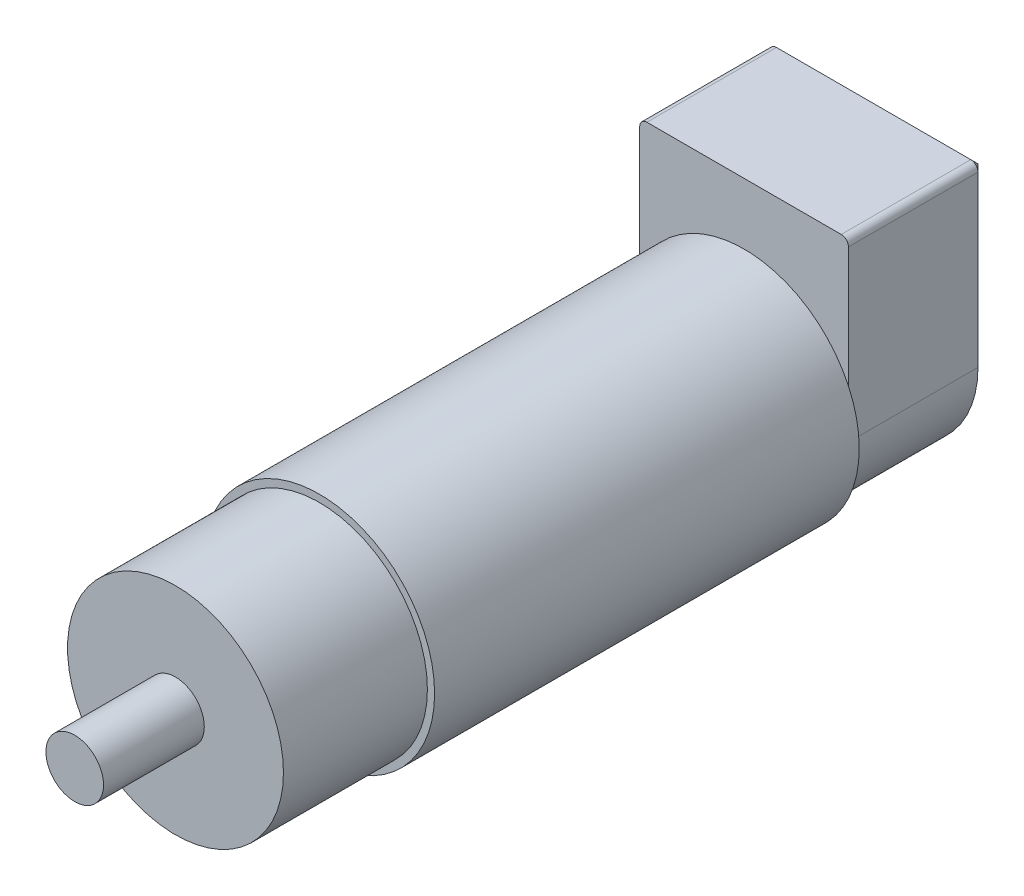
ISO-10303-21;
HEADER;
FILE_DESCRIPTION(('STEP AP214'),'2;1');
FILE_NAME('part.step','',(''),(''),'','','');
FILE_SCHEMA(('AUTOMOTIVE_DESIGN { 1 0 10303 214 1 1 1 1 }'));
ENDSEC;
DATA;
#1=APPLICATION_CONTEXT('core data for automotive mechanical design processes');
#2=APPLICATION_PROTOCOL_DEFINITION('international standard','automotive_design',2000,#1);
#3=PRODUCT_CONTEXT('',#1,'mechanical');
#4=PRODUCT('Part','Part','',(#3));
#5=PRODUCT_RELATED_PRODUCT_CATEGORY('part','',(#4));
#6=PRODUCT_DEFINITION_FORMATION('','',#4);
#7=PRODUCT_DEFINITION_CONTEXT('part definition',#1,'design');
#8=PRODUCT_DEFINITION('design','',#6,#7);
#9=PRODUCT_DEFINITION_SHAPE('','',#8);
#10=(LENGTH_UNIT() NAMED_UNIT(*) SI_UNIT(.MILLI.,.METRE.));
#11=(NAMED_UNIT(*) PLANE_ANGLE_UNIT() SI_UNIT($,.RADIAN.));
#12=(NAMED_UNIT(*) SI_UNIT($,.STERADIAN.) SOLID_ANGLE_UNIT());
#13=UNCERTAINTY_MEASURE_WITH_UNIT(LENGTH_MEASURE(1.E-05),#10,'distance_accuracy_value','');
#14=(GEOMETRIC_REPRESENTATION_CONTEXT(3) GLOBAL_UNCERTAINTY_ASSIGNED_CONTEXT((#13)) GLOBAL_UNIT_ASSIGNED_CONTEXT((#10,
#11,#12)) REPRESENTATION_CONTEXT('',''));
#15=CARTESIAN_POINT('',(0.,0.,0.));
#16=DIRECTION('',(0.,0.,1.));
#17=DIRECTION('',(1.,0.,0.));
#18=AXIS2_PLACEMENT_3D('',#15,#16,#17);
#19=CARTESIAN_POINT('',(0.,0.,0.));
#20=DIRECTION('',(0.,0.,1.));
#21=DIRECTION('',(1.,0.,0.));
#22=AXIS2_PLACEMENT_3D('',#19,#20,#21);
#23=PLANE('',#22);
#24=DIRECTION('',(0.,-1.,0.));
#25=VECTOR('',#24,1.);
#26=CARTESIAN_POINT('',(14.5,0.,0.));
#27=LINE('',#26,#25);
#28=CARTESIAN_POINT('',(14.5,6.76387462923434,0.));
#29=VERTEX_POINT('',#28);
#30=CARTESIAN_POINT('',(14.5,0.,0.));
#31=VERTEX_POINT('',#30);
#32=EDGE_CURVE('E142',#29,#31,#27,.T.);
#33=ORIENTED_EDGE('',*,*,#32,.F.);
#34=CARTESIAN_POINT('',(0.,0.,0.));
#35=DIRECTION('',(0.,0.,1.));
#36=DIRECTION('',(1.,0.,0.));
#37=AXIS2_PLACEMENT_3D('',#34,#35,#36);
#38=CIRCLE('',#37,16.);
#39=CARTESIAN_POINT('',(-14.5,6.76387462923434,0.));
#40=VERTEX_POINT('',#39);
#41=EDGE_CURVE('E162',#40,#29,#38,.T.);
#42=ORIENTED_EDGE('',*,*,#41,.F.);
#43=DIRECTION('',(0.,1.,0.));
#44=VECTOR('',#43,1.);
#45=CARTESIAN_POINT('',(-14.5,0.,0.));
#46=LINE('',#45,#44);
#47=CARTESIAN_POINT('',(-14.5,0.,0.));
#48=VERTEX_POINT('',#47);
#49=EDGE_CURVE('E122',#48,#40,#46,.T.);
#50=ORIENTED_EDGE('',*,*,#49,.F.);
#51=CARTESIAN_POINT('',(0.,0.,0.));
#52=DIRECTION('',(0.,0.,-1.));
#53=DIRECTION('',(-1.,0.,0.));
#54=AXIS2_PLACEMENT_3D('',#51,#52,#53);
#55=CIRCLE('',#54,14.5);
#56=EDGE_CURVE('E125',#31,#48,#55,.T.);
#57=ORIENTED_EDGE('',*,*,#56,.F.);
#58=EDGE_LOOP('',(#33,#42,#50,#57));
#59=FACE_BOUND('',#58,.T.);
#60=ADVANCED_FACE('F35',(#59),#23,.F.);
#61=CARTESIAN_POINT('',(0.,0.,79.));
#62=DIRECTION('',(0.,0.,1.));
#63=DIRECTION('',(1.,0.,0.));
#64=AXIS2_PLACEMENT_3D('',#61,#62,#63);
#65=PLANE('',#64);
#66=CARTESIAN_POINT('',(0.,0.,79.));
#67=DIRECTION('',(0.,0.,1.));
#68=DIRECTION('',(1.,0.,0.));
#69=AXIS2_PLACEMENT_3D('',#66,#67,#68);
#70=CIRCLE('',#69,4.);
#71=CARTESIAN_POINT('',(4.,0.,79.));
#72=VERTEX_POINT('',#71);
#73=EDGE_CURVE('E163',#72,#72,#70,.T.);
#74=ORIENTED_EDGE('',*,*,#73,.F.);
#75=EDGE_LOOP('',(#74));
#76=FACE_BOUND('',#75,.T.);
#77=CARTESIAN_POINT('',(0.,0.,79.));
#78=DIRECTION('',(0.,0.,1.));
#79=DIRECTION('',(1.,0.,0.));
#80=AXIS2_PLACEMENT_3D('',#77,#78,#79);
#81=CIRCLE('',#80,15.);
#82=CARTESIAN_POINT('',(15.,0.,79.));
#83=VERTEX_POINT('',#82);
#84=EDGE_CURVE('E150',#83,#83,#81,.T.);
#85=ORIENTED_EDGE('',*,*,#84,.T.);
#86=EDGE_LOOP('',(#85));
#87=FACE_BOUND('',#86,.T.);
#88=ADVANCED_FACE('F240',(#76,#87),#65,.T.);
#89=CARTESIAN_POINT('',(0.,0.,93.));
#90=DIRECTION('',(0.,0.,-1.));
#91=DIRECTION('',(-1.,0.,0.));
#92=AXIS2_PLACEMENT_3D('',#89,#90,#91);
#93=CYLINDRICAL_SURFACE('',#92,4.);
#94=CARTESIAN_POINT('',(0.,0.,93.));
#95=DIRECTION('',(0.,0.,1.));
#96=DIRECTION('',(1.,0.,0.));
#97=AXIS2_PLACEMENT_3D('',#94,#95,#96);
#98=CIRCLE('',#97,4.);
#99=CARTESIAN_POINT('',(4.,0.,93.));
#100=VERTEX_POINT('',#99);
#101=EDGE_CURVE('E159',#100,#100,#98,.T.);
#102=ORIENTED_EDGE('',*,*,#101,.F.);
#103=EDGE_LOOP('',(#102));
#104=FACE_BOUND('',#103,.T.);
#105=ORIENTED_EDGE('',*,*,#73,.T.);
#106=EDGE_LOOP('',(#105));
#107=FACE_BOUND('',#106,.T.);
#108=ADVANCED_FACE('F235',(#104,#107),#93,.T.);
#109=CARTESIAN_POINT('',(0.,0.,93.));
#110=DIRECTION('',(0.,0.,1.));
#111=DIRECTION('',(1.,0.,0.));
#112=AXIS2_PLACEMENT_3D('',#109,#110,#111);
#113=PLANE('',#112);
#114=ORIENTED_EDGE('',*,*,#101,.T.);
#115=EDGE_LOOP('',(#114));
#116=FACE_BOUND('',#115,.T.);
#117=ADVANCED_FACE('F226',(#116),#113,.T.);
#118=CARTESIAN_POINT('',(0.,0.,59.));
#119=DIRECTION('',(0.,0.,1.));
#120=DIRECTION('',(1.,0.,0.));
#121=AXIS2_PLACEMENT_3D('',#118,#119,#120);
#122=PLANE('',#121);
#123=CARTESIAN_POINT('',(0.,0.,59.));
#124=DIRECTION('',(0.,0.,1.));
#125=DIRECTION('',(1.,0.,0.));
#126=AXIS2_PLACEMENT_3D('',#123,#124,#125);
#127=CIRCLE('',#126,15.);
#128=CARTESIAN_POINT('',(15.,0.,59.));
#129=VERTEX_POINT('',#128);
#130=EDGE_CURVE('E151',#129,#129,#127,.T.);
#131=ORIENTED_EDGE('',*,*,#130,.F.);
#132=EDGE_LOOP('',(#131));
#133=FACE_BOUND('',#132,.T.);
#134=CARTESIAN_POINT('',(0.,0.,59.));
#135=DIRECTION('',(0.,0.,1.));
#136=DIRECTION('',(1.,0.,0.));
#137=AXIS2_PLACEMENT_3D('',#134,#135,#136);
#138=CIRCLE('',#137,16.);
#139=CARTESIAN_POINT('',(16.,0.,59.));
#140=VERTEX_POINT('',#139);
#141=EDGE_CURVE('E154',#140,#140,#138,.T.);
#142=ORIENTED_EDGE('',*,*,#141,.T.);
#143=EDGE_LOOP('',(#142));
#144=FACE_BOUND('',#143,.T.);
#145=ADVANCED_FACE('F224',(#133,#144),#122,.T.);
#146=CARTESIAN_POINT('',(0.,0.,59.));
#147=DIRECTION('',(0.,0.,1.));
#148=DIRECTION('',(1.,0.,0.));
#149=AXIS2_PLACEMENT_3D('',#146,#147,#148);
#150=CYLINDRICAL_SURFACE('',#149,15.);
#151=ORIENTED_EDGE('',*,*,#130,.T.);
#152=EDGE_LOOP('',(#151));
#153=FACE_BOUND('',#152,.T.);
#154=ORIENTED_EDGE('',*,*,#84,.F.);
#155=EDGE_LOOP('',(#154));
#156=FACE_BOUND('',#155,.T.);
#157=ADVANCED_FACE('F220',(#153,#156),#150,.T.);
#158=CARTESIAN_POINT('',(0.,0.,79.));
#159=DIRECTION('',(0.,0.,-1.));
#160=DIRECTION('',(-1.,0.,0.));
#161=AXIS2_PLACEMENT_3D('',#158,#159,#160);
#162=CYLINDRICAL_SURFACE('',#161,16.);
#163=EDGE_CURVE('E166',#29,#40,#38,.T.);
#164=ORIENTED_EDGE('',*,*,#163,.T.);
#165=ORIENTED_EDGE('',*,*,#41,.T.);
#166=EDGE_LOOP('',(#164,#165));
#167=FACE_BOUND('',#166,.T.);
#168=ORIENTED_EDGE('',*,*,#141,.F.);
#169=EDGE_LOOP('',(#168));
#170=FACE_BOUND('',#169,.T.);
#171=ADVANCED_FACE('F217',(#167,#170),#162,.T.);
#172=CARTESIAN_POINT('',(0.,0.,-19.));
#173=DIRECTION('',(0.,0.,1.));
#174=DIRECTION('',(1.,0.,0.));
#175=AXIS2_PLACEMENT_3D('',#172,#173,#174);
#176=CYLINDRICAL_SURFACE('',#175,14.5);
#177=DIRECTION('',(0.,0.,1.));
#178=VECTOR('',#177,1.);
#179=CARTESIAN_POINT('',(-14.5,0.,-19.));
#180=LINE('',#179,#178);
#181=CARTESIAN_POINT('',(-14.5,0.,-18.));
#182=VERTEX_POINT('',#181);
#183=EDGE_CURVE('E114',#182,#48,#180,.T.);
#184=ORIENTED_EDGE('',*,*,#183,.F.);
#185=CARTESIAN_POINT('',(0.,0.,-18.));
#186=DIRECTION('',(0.,0.,-1.));
#187=DIRECTION('',(-1.,0.,0.));
#188=AXIS2_PLACEMENT_3D('',#185,#186,#187);
#189=CIRCLE('',#188,14.5);
#190=CARTESIAN_POINT('',(14.5,0.,-18.));
#191=VERTEX_POINT('',#190);
#192=EDGE_CURVE('E11',#182,#191,#189,.F.);
#193=ORIENTED_EDGE('',*,*,#192,.T.);
#194=DIRECTION('',(0.,0.,1.));
#195=VECTOR('',#194,1.);
#196=CARTESIAN_POINT('',(14.5,0.,-19.));
#197=LINE('',#196,#195);
#198=EDGE_CURVE('E141',#191,#31,#197,.T.);
#199=ORIENTED_EDGE('',*,*,#198,.T.);
#200=ORIENTED_EDGE('',*,*,#56,.T.);
#201=EDGE_LOOP('',(#184,#193,#199,#200));
#202=FACE_BOUND('',#201,.T.);
#203=ADVANCED_FACE('F207',(#202),#176,.T.);
#204=CARTESIAN_POINT('',(-14.5,0.,-19.));
#205=DIRECTION('',(1.,0.,0.));
#206=DIRECTION('',(0.,0.,-1.));
#207=AXIS2_PLACEMENT_3D('',#204,#205,#206);
#208=PLANE('',#207);
#209=DIRECTION('',(0.,0.,1.));
#210=VECTOR('',#209,1.);
#211=CARTESIAN_POINT('',(-14.5,23.5,-19.));
#212=LINE('',#211,#210);
#213=CARTESIAN_POINT('',(-14.5,23.5,-18.));
#214=VERTEX_POINT('',#213);
#215=CARTESIAN_POINT('',(-14.5,23.5,0.));
#216=VERTEX_POINT('',#215);
#217=EDGE_CURVE('E105',#214,#216,#212,.T.);
#218=ORIENTED_EDGE('',*,*,#217,.F.);
#219=DIRECTION('',(0.,-1.,0.));
#220=VECTOR('',#219,1.);
#221=CARTESIAN_POINT('',(-14.5,0.,-18.));
#222=LINE('',#221,#220);
#223=EDGE_CURVE('E44',#214,#182,#222,.T.);
#224=ORIENTED_EDGE('',*,*,#223,.T.);
#225=ORIENTED_EDGE('',*,*,#183,.T.);
#226=ORIENTED_EDGE('',*,*,#49,.T.);
#227=EDGE_CURVE('E119',#40,#216,#46,.T.);
#228=ORIENTED_EDGE('',*,*,#227,.T.);
#229=EDGE_LOOP('',(#218,#224,#225,#226,#228));
#230=FACE_BOUND('',#229,.T.);
#231=ADVANCED_FACE('F120',(#230),#208,.F.);
#232=CARTESIAN_POINT('',(-13.5,23.5,-19.));
#233=DIRECTION('',(0.,0.,1.));
#234=DIRECTION('',(1.,0.,0.));
#235=AXIS2_PLACEMENT_3D('',#232,#233,#234);
#236=CYLINDRICAL_SURFACE('',#235,1.);
#237=DIRECTION('',(0.,0.,1.));
#238=VECTOR('',#237,1.);
#239=CARTESIAN_POINT('',(-13.5,24.5,-19.));
#240=LINE('',#239,#238);
#241=CARTESIAN_POINT('',(-13.5,24.5,-18.));
#242=VERTEX_POINT('',#241);
#243=CARTESIAN_POINT('',(-13.5,24.5,0.));
#244=VERTEX_POINT('',#243);
#245=EDGE_CURVE('E115',#242,#244,#240,.T.);
#246=ORIENTED_EDGE('',*,*,#245,.F.);
#247=CARTESIAN_POINT('',(-13.5,23.5,-18.));
#248=DIRECTION('',(0.,0.,-1.));
#249=DIRECTION('',(-1.,0.,0.));
#250=AXIS2_PLACEMENT_3D('',#247,#248,#249);
#251=CIRCLE('',#250,1.);
#252=EDGE_CURVE('E113',#242,#214,#251,.F.);
#253=ORIENTED_EDGE('',*,*,#252,.T.);
#254=ORIENTED_EDGE('',*,*,#217,.T.);
#255=CARTESIAN_POINT('',(-13.5,23.5,0.));
#256=DIRECTION('',(0.,0.,-1.));
#257=DIRECTION('',(-1.,0.,0.));
#258=AXIS2_PLACEMENT_3D('',#255,#256,#257);
#259=CIRCLE('',#258,1.);
#260=EDGE_CURVE('E110',#216,#244,#259,.T.);
#261=ORIENTED_EDGE('',*,*,#260,.T.);
#262=EDGE_LOOP('',(#246,#253,#254,#261));
#263=FACE_BOUND('',#262,.T.);
#264=ADVANCED_FACE('F108',(#263),#236,.T.);
#265=CARTESIAN_POINT('',(-13.5,24.5,-19.));
#266=DIRECTION('',(0.,-1.,0.));
#267=DIRECTION('',(1.,0.,0.));
#268=AXIS2_PLACEMENT_3D('',#265,#266,#267);
#269=PLANE('',#268);
#270=DIRECTION('',(0.,0.,1.));
#271=VECTOR('',#270,1.);
#272=CARTESIAN_POINT('',(13.5,24.5,-19.));
#273=LINE('',#272,#271);
#274=CARTESIAN_POINT('',(13.5,24.5,-18.));
#275=VERTEX_POINT('',#274);
#276=CARTESIAN_POINT('',(13.5,24.5,0.));
#277=VERTEX_POINT('',#276);
#278=EDGE_CURVE('E146',#275,#277,#273,.T.);
#279=ORIENTED_EDGE('',*,*,#278,.F.);
#280=DIRECTION('',(-1.,0.,0.));
#281=VECTOR('',#280,1.);
#282=CARTESIAN_POINT('',(-13.5,24.5,-18.));
#283=LINE('',#282,#281);
#284=EDGE_CURVE('E177',#275,#242,#283,.T.);
#285=ORIENTED_EDGE('',*,*,#284,.T.);
#286=ORIENTED_EDGE('',*,*,#245,.T.);
#287=DIRECTION('',(1.,0.,0.));
#288=VECTOR('',#287,1.);
#289=CARTESIAN_POINT('',(-13.5,24.5,0.));
#290=LINE('',#289,#288);
#291=EDGE_CURVE('E130',#244,#277,#290,.T.);
#292=ORIENTED_EDGE('',*,*,#291,.T.);
#293=EDGE_LOOP('',(#279,#285,#286,#292));
#294=FACE_BOUND('',#293,.T.);
#295=ADVANCED_FACE('F282',(#294),#269,.F.);
#296=CARTESIAN_POINT('',(13.5,23.5,-19.));
#297=DIRECTION('',(0.,0.,1.));
#298=DIRECTION('',(1.,0.,0.));
#299=AXIS2_PLACEMENT_3D('',#296,#297,#298);
#300=CYLINDRICAL_SURFACE('',#299,1.);
#301=DIRECTION('',(0.,0.,1.));
#302=VECTOR('',#301,1.);
#303=CARTESIAN_POINT('',(14.5,23.5,-19.));
#304=LINE('',#303,#302);
#305=CARTESIAN_POINT('',(14.5,23.5,-18.));
#306=VERTEX_POINT('',#305);
#307=CARTESIAN_POINT('',(14.5,23.5,0.));
#308=VERTEX_POINT('',#307);
#309=EDGE_CURVE('E144',#306,#308,#304,.T.);
#310=ORIENTED_EDGE('',*,*,#309,.F.);
#311=CARTESIAN_POINT('',(13.5,23.5,-18.));
#312=DIRECTION('',(0.,0.,-1.));
#313=DIRECTION('',(-1.,0.,0.));
#314=AXIS2_PLACEMENT_3D('',#311,#312,#313);
#315=CIRCLE('',#314,1.);
#316=EDGE_CURVE('E180',#306,#275,#315,.F.);
#317=ORIENTED_EDGE('',*,*,#316,.T.);
#318=ORIENTED_EDGE('',*,*,#278,.T.);
#319=CARTESIAN_POINT('',(13.5,23.5,0.));
#320=DIRECTION('',(0.,0.,-1.));
#321=DIRECTION('',(-1.,0.,0.));
#322=AXIS2_PLACEMENT_3D('',#319,#320,#321);
#323=CIRCLE('',#322,1.);
#324=EDGE_CURVE('E132',#277,#308,#323,.T.);
#325=ORIENTED_EDGE('',*,*,#324,.T.);
#326=EDGE_LOOP('',(#310,#317,#318,#325));
#327=FACE_BOUND('',#326,.T.);
#328=ADVANCED_FACE('F278',(#327),#300,.T.);
#329=CARTESIAN_POINT('',(14.5,0.,-19.));
#330=DIRECTION('',(-1.,0.,0.));
#331=DIRECTION('',(0.,0.,1.));
#332=AXIS2_PLACEMENT_3D('',#329,#330,#331);
#333=PLANE('',#332);
#334=ORIENTED_EDGE('',*,*,#198,.F.);
#335=DIRECTION('',(0.,1.,0.));
#336=VECTOR('',#335,1.);
#337=CARTESIAN_POINT('',(14.5,23.5,-18.));
#338=LINE('',#337,#336);
#339=EDGE_CURVE('E183',#191,#306,#338,.T.);
#340=ORIENTED_EDGE('',*,*,#339,.T.);
#341=ORIENTED_EDGE('',*,*,#309,.T.);
#342=EDGE_CURVE('E138',#308,#29,#27,.T.);
#343=ORIENTED_EDGE('',*,*,#342,.T.);
#344=ORIENTED_EDGE('',*,*,#32,.T.);
#345=EDGE_LOOP('',(#334,#340,#341,#343,#344));
#346=FACE_BOUND('',#345,.T.);
#347=ADVANCED_FACE('F213',(#346),#333,.F.);
#348=CARTESIAN_POINT('',(0.,0.,-19.));
#349=DIRECTION('',(0.,0.,-1.));
#350=DIRECTION('',(-1.,0.,0.));
#351=AXIS2_PLACEMENT_3D('',#348,#349,#350);
#352=PLANE('',#351);
#353=DIRECTION('',(0.,1.,0.));
#354=VECTOR('',#353,1.);
#355=CARTESIAN_POINT('',(-13.5,23.5,-19.));
#356=LINE('',#355,#354);
#357=CARTESIAN_POINT('',(-13.5,0.,-19.));
#358=VERTEX_POINT('',#357);
#359=CARTESIAN_POINT('',(-13.5,23.5,-19.));
#360=VERTEX_POINT('',#359);
#361=EDGE_CURVE('E170',#358,#360,#356,.T.);
#362=ORIENTED_EDGE('',*,*,#361,.T.);
#363=DIRECTION('',(1.,0.,0.));
#364=VECTOR('',#363,1.);
#365=CARTESIAN_POINT('',(13.5,23.5,-19.));
#366=LINE('',#365,#364);
#367=CARTESIAN_POINT('',(13.5,23.5,-19.));
#368=VERTEX_POINT('',#367);
#369=EDGE_CURVE('E174',#360,#368,#366,.T.);
#370=ORIENTED_EDGE('',*,*,#369,.T.);
#371=DIRECTION('',(0.,-1.,0.));
#372=VECTOR('',#371,1.);
#373=CARTESIAN_POINT('',(13.5,0.,-19.));
#374=LINE('',#373,#372);
#375=CARTESIAN_POINT('',(13.5,0.,-19.));
#376=VERTEX_POINT('',#375);
#377=EDGE_CURVE('E172',#368,#376,#374,.T.);
#378=ORIENTED_EDGE('',*,*,#377,.T.);
#379=CARTESIAN_POINT('',(0.,0.,-19.));
#380=DIRECTION('',(0.,0.,-1.));
#381=DIRECTION('',(-1.,0.,0.));
#382=AXIS2_PLACEMENT_3D('',#379,#380,#381);
#383=CIRCLE('',#382,13.5);
#384=EDGE_CURVE('E168',#376,#358,#383,.T.);
#385=ORIENTED_EDGE('',*,*,#384,.T.);
#386=EDGE_LOOP('',(#362,#370,#378,#385));
#387=FACE_BOUND('',#386,.T.);
#388=ADVANCED_FACE('F272',(#387),#352,.T.);
#389=CARTESIAN_POINT('',(0.,0.,0.));
#390=DIRECTION('',(0.,0.,-1.));
#391=DIRECTION('',(-1.,0.,0.));
#392=AXIS2_PLACEMENT_3D('',#389,#390,#391);
#393=PLANE('',#392);
#394=ORIENTED_EDGE('',*,*,#163,.F.);
#395=ORIENTED_EDGE('',*,*,#342,.F.);
#396=ORIENTED_EDGE('',*,*,#324,.F.);
#397=ORIENTED_EDGE('',*,*,#291,.F.);
#398=ORIENTED_EDGE('',*,*,#260,.F.);
#399=ORIENTED_EDGE('',*,*,#227,.F.);
#400=EDGE_LOOP('',(#394,#395,#396,#397,#398,#399));
#401=FACE_BOUND('',#400,.T.);
#402=ADVANCED_FACE('F127',(#401),#393,.F.);
#403=CARTESIAN_POINT('',(0.,0.,-19.));
#404=DIRECTION('',(0.,0.,1.));
#405=DIRECTION('',(1.,0.,0.));
#406=AXIS2_PLACEMENT_3D('',#403,#404,#405);
#407=CONICAL_SURFACE('',#406,13.5,0.785398163397451);
#408=DIRECTION('',(-0.707106781186549,0.,-0.707106781186546));
#409=VECTOR('',#408,1.);
#410=CARTESIAN_POINT('',(14.5,0.,-18.));
#411=LINE('',#410,#409);
#412=EDGE_CURVE('E195',#191,#376,#411,.T.);
#413=ORIENTED_EDGE('',*,*,#412,.F.);
#414=ORIENTED_EDGE('',*,*,#192,.F.);
#415=DIRECTION('',(-0.707106781186549,0.,0.707106781186546));
#416=VECTOR('',#415,1.);
#417=CARTESIAN_POINT('',(-13.5,0.,-19.));
#418=LINE('',#417,#416);
#419=EDGE_CURVE('E39',#358,#182,#418,.T.);
#420=ORIENTED_EDGE('',*,*,#419,.F.);
#421=ORIENTED_EDGE('',*,*,#384,.F.);
#422=EDGE_LOOP('',(#413,#414,#420,#421));
#423=FACE_BOUND('',#422,.T.);
#424=ADVANCED_FACE('F37',(#423),#407,.T.);
#425=CARTESIAN_POINT('',(-13.5,0.,-19.));
#426=DIRECTION('',(-0.707106781186546,0.,-0.707106781186549));
#427=DIRECTION('',(0.,-1.,0.));
#428=AXIS2_PLACEMENT_3D('',#425,#426,#427);
#429=PLANE('',#428);
#430=ORIENTED_EDGE('',*,*,#419,.T.);
#431=ORIENTED_EDGE('',*,*,#223,.F.);
#432=DIRECTION('',(-0.707106781186549,0.,0.707106781186546));
#433=VECTOR('',#432,1.);
#434=CARTESIAN_POINT('',(-13.5,23.5,-19.));
#435=LINE('',#434,#433);
#436=EDGE_CURVE('E193',#360,#214,#435,.T.);
#437=ORIENTED_EDGE('',*,*,#436,.F.);
#438=ORIENTED_EDGE('',*,*,#361,.F.);
#439=EDGE_LOOP('',(#430,#431,#437,#438));
#440=FACE_BOUND('',#439,.T.);
#441=ADVANCED_FACE('F263',(#440),#429,.T.);
#442=CARTESIAN_POINT('',(13.5,0.,-19.));
#443=DIRECTION('',(0.707106781186546,0.,-0.707106781186549));
#444=DIRECTION('',(0.,1.,0.));
#445=AXIS2_PLACEMENT_3D('',#442,#443,#444);
#446=PLANE('',#445);
#447=ORIENTED_EDGE('',*,*,#412,.T.);
#448=ORIENTED_EDGE('',*,*,#377,.F.);
#449=DIRECTION('',(-0.707106781186549,0.,-0.707106781186546));
#450=VECTOR('',#449,1.);
#451=CARTESIAN_POINT('',(14.5,23.5,-18.));
#452=LINE('',#451,#450);
#453=EDGE_CURVE('E190',#306,#368,#452,.T.);
#454=ORIENTED_EDGE('',*,*,#453,.F.);
#455=ORIENTED_EDGE('',*,*,#339,.F.);
#456=EDGE_LOOP('',(#447,#448,#454,#455));
#457=FACE_BOUND('',#456,.T.);
#458=ADVANCED_FACE('F260',(#457),#446,.T.);
#459=CARTESIAN_POINT('',(-13.5,23.5,-18.));
#460=DIRECTION('',(0.,0.,1.));
#461=DIRECTION('',(1.,0.,0.));
#462=AXIS2_PLACEMENT_3D('',#459,#460,#461);
#463=CONICAL_SURFACE('',#462,1.,0.785398163397451);
#464=ORIENTED_EDGE('',*,*,#436,.T.);
#465=ORIENTED_EDGE('',*,*,#252,.F.);
#466=DIRECTION('',(0.,0.707106781186549,0.707106781186546));
#467=VECTOR('',#466,1.);
#468=CARTESIAN_POINT('',(-13.5,23.5,-19.));
#469=LINE('',#468,#467);
#470=EDGE_CURVE('E188',#360,#242,#469,.T.);
#471=ORIENTED_EDGE('',*,*,#470,.F.);
#472=EDGE_LOOP('',(#464,#465,#471));
#473=FACE_BOUND('',#472,.T.);
#474=ADVANCED_FACE('F256',(#473),#463,.T.);
#475=CARTESIAN_POINT('',(13.5,23.5,-18.));
#476=DIRECTION('',(0.,0.,1.));
#477=DIRECTION('',(1.,0.,0.));
#478=AXIS2_PLACEMENT_3D('',#475,#476,#477);
#479=CONICAL_SURFACE('',#478,1.,0.785398163397451);
#480=ORIENTED_EDGE('',*,*,#316,.F.);
#481=ORIENTED_EDGE('',*,*,#453,.T.);
#482=DIRECTION('',(0.,-0.707106781186549,-0.707106781186546));
#483=VECTOR('',#482,1.);
#484=CARTESIAN_POINT('',(13.5,24.5,-18.));
#485=LINE('',#484,#483);
#486=EDGE_CURVE('E186',#275,#368,#485,.T.);
#487=ORIENTED_EDGE('',*,*,#486,.F.);
#488=EDGE_LOOP('',(#480,#481,#487));
#489=FACE_BOUND('',#488,.T.);
#490=ADVANCED_FACE('F252',(#489),#479,.T.);
#491=CARTESIAN_POINT('',(0.,23.5,-19.));
#492=DIRECTION('',(0.,0.707106781186546,-0.707106781186549));
#493=DIRECTION('',(-1.,0.,0.));
#494=AXIS2_PLACEMENT_3D('',#491,#492,#493);
#495=PLANE('',#494);
#496=ORIENTED_EDGE('',*,*,#470,.T.);
#497=ORIENTED_EDGE('',*,*,#284,.F.);
#498=ORIENTED_EDGE('',*,*,#486,.T.);
#499=ORIENTED_EDGE('',*,*,#369,.F.);
#500=EDGE_LOOP('',(#496,#497,#498,#499));
#501=FACE_BOUND('',#500,.T.);
#502=ADVANCED_FACE('F249',(#501),#495,.T.);
#503=CLOSED_SHELL('',(#60,#88,#108,#117,#145,#157,#171,#203,#231,#264,#295,#328,#347,#388,#402,
#424,#441,#458,#474,#490,#502));
#504=MANIFOLD_SOLID_BREP('B2',#503);
#505=ADVANCED_BREP_SHAPE_REPRESENTATION('',(#18,#504),#14);
#506=SHAPE_DEFINITION_REPRESENTATION(#9,#505);
ENDSEC;
END-ISO-10303-21;
